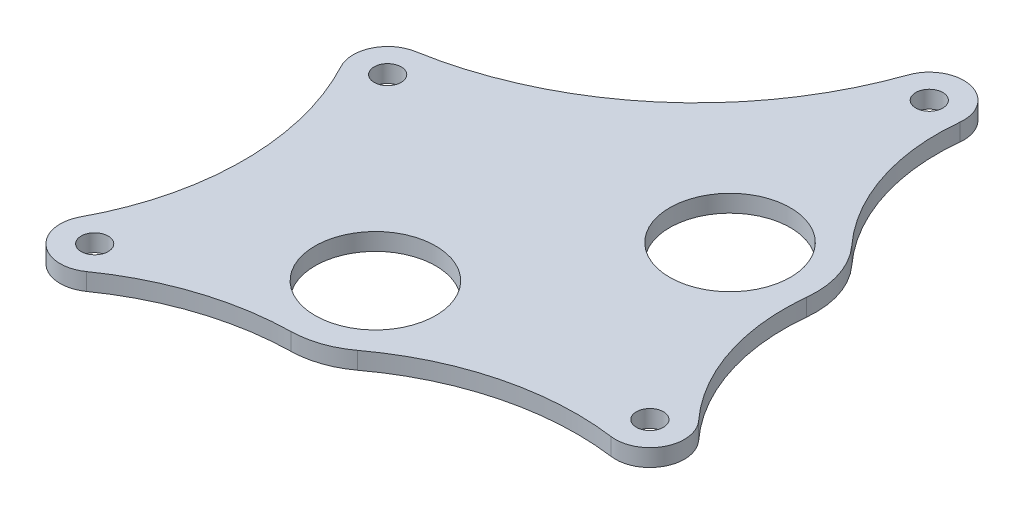
ISO-10303-21;
HEADER;
FILE_DESCRIPTION(('STEP AP214'),'2;1');
FILE_NAME('part.step','',(''),(''),'','','');
FILE_SCHEMA(('AUTOMOTIVE_DESIGN { 1 0 10303 214 1 1 1 1 }'));
ENDSEC;
DATA;
#1=APPLICATION_CONTEXT('core data for automotive mechanical design processes');
#2=APPLICATION_PROTOCOL_DEFINITION('international standard','automotive_design',2000,#1);
#3=PRODUCT_CONTEXT('',#1,'mechanical');
#4=PRODUCT('Part','Part','',(#3));
#5=PRODUCT_RELATED_PRODUCT_CATEGORY('part','',(#4));
#6=PRODUCT_DEFINITION_FORMATION('','',#4);
#7=PRODUCT_DEFINITION_CONTEXT('part definition',#1,'design');
#8=PRODUCT_DEFINITION('design','',#6,#7);
#9=PRODUCT_DEFINITION_SHAPE('','',#8);
#10=(LENGTH_UNIT() NAMED_UNIT(*) SI_UNIT(.MILLI.,.METRE.));
#11=(NAMED_UNIT(*) PLANE_ANGLE_UNIT() SI_UNIT($,.RADIAN.));
#12=(NAMED_UNIT(*) SI_UNIT($,.STERADIAN.) SOLID_ANGLE_UNIT());
#13=UNCERTAINTY_MEASURE_WITH_UNIT(LENGTH_MEASURE(1.E-05),#10,'distance_accuracy_value','');
#14=(GEOMETRIC_REPRESENTATION_CONTEXT(3) GLOBAL_UNCERTAINTY_ASSIGNED_CONTEXT((#13)) GLOBAL_UNIT_ASSIGNED_CONTEXT((#10,
#11,#12)) REPRESENTATION_CONTEXT('',''));
#15=CARTESIAN_POINT('',(0.,0.,0.));
#16=DIRECTION('',(0.,0.,1.));
#17=DIRECTION('',(1.,0.,0.));
#18=AXIS2_PLACEMENT_3D('',#15,#16,#17);
#19=CARTESIAN_POINT('',(40.1473132785361,14.6049999999996,-115.016732099235));
#20=DIRECTION('',(0.,1.,0.));
#21=DIRECTION('',(0.,0.,1.));
#22=AXIS2_PLACEMENT_3D('',#19,#20,#21);
#23=PLANE('',#22);
#24=CARTESIAN_POINT('',(20.2144717895034,14.6049999999997,-96.823134697316));
#25=DIRECTION('',(0.,1.,0.));
#26=DIRECTION('',(0.,0.,1.));
#27=AXIS2_PLACEMENT_3D('',#24,#25,#26);
#28=CIRCLE('',#27,11.1125);
#29=CARTESIAN_POINT('',(20.2144717895034,14.6049999999997,-85.710634697316));
#30=VERTEX_POINT('',#29);
#31=EDGE_CURVE('E299',#30,#30,#28,.T.);
#32=ORIENTED_EDGE('',*,*,#31,.F.);
#33=EDGE_LOOP('',(#32));
#34=FACE_BOUND('',#33,.T.);
#35=CARTESIAN_POINT('',(15.8750000000005,14.6049999999995,-137.869384338277));
#36=DIRECTION('',(0.,1.,0.));
#37=DIRECTION('',(0.,0.,1.));
#38=AXIS2_PLACEMENT_3D('',#35,#36,#37);
#39=CIRCLE('',#38,2.4892);
#40=CARTESIAN_POINT('',(15.8750000000005,14.6049999999995,-135.380184338277));
#41=VERTEX_POINT('',#40);
#42=EDGE_CURVE('E311',#41,#41,#39,.T.);
#43=ORIENTED_EDGE('',*,*,#42,.F.);
#44=EDGE_LOOP('',(#43));
#45=FACE_BOUND('',#44,.T.);
#46=CARTESIAN_POINT('',(-38.0999999999997,14.6049999999997,-92.0750000000001));
#47=DIRECTION('',(0.,1.,0.));
#48=DIRECTION('',(0.,0.,1.));
#49=AXIS2_PLACEMENT_3D('',#46,#47,#48);
#50=CIRCLE('',#49,2.4892);
#51=CARTESIAN_POINT('',(-38.0999999999997,14.6049999999997,-89.5858000000001));
#52=VERTEX_POINT('',#51);
#53=EDGE_CURVE('E158',#52,#52,#50,.T.);
#54=ORIENTED_EDGE('',*,*,#53,.F.);
#55=EDGE_LOOP('',(#54));
#56=FACE_BOUND('',#55,.T.);
#57=CARTESIAN_POINT('',(60.0801547675688,14.6049999999995,-133.210329501153));
#58=DIRECTION('',(0.,-1.,0.));
#59=DIRECTION('',(0.,0.,1.));
#60=AXIS2_PLACEMENT_3D('',#57,#58,#59);
#61=CIRCLE('',#60,38.1);
#62=CARTESIAN_POINT('',(31.939672665405,14.6049999999996,-107.525250816092));
#63=VERTEX_POINT('',#62);
#64=CARTESIAN_POINT('',(22.1900221096531,14.6049999999995,-137.203805075831));
#65=VERTEX_POINT('',#64);
#66=EDGE_CURVE('E177',#63,#65,#61,.T.);
#67=ORIENTED_EDGE('',*,*,#66,.T.);
#68=CARTESIAN_POINT('',(15.8750000000005,14.6049999999995,-137.869384338277));
#69=DIRECTION('',(0.,1.,0.));
#70=DIRECTION('',(0.,0.,1.));
#71=AXIS2_PLACEMENT_3D('',#68,#69,#70);
#72=CIRCLE('',#71,6.34999999999999);
#73=CARTESIAN_POINT('',(9.8798155737633,14.6049999999995,-139.962292290244));
#74=VERTEX_POINT('',#73);
#75=EDGE_CURVE('E105',#65,#74,#72,.T.);
#76=ORIENTED_EDGE('',*,*,#75,.T.);
#77=CARTESIAN_POINT('',(-50.0720286886084,14.6049999999994,-160.891371809905));
#78=DIRECTION('',(0.,-1.,0.));
#79=DIRECTION('',(0.,0.,1.));
#80=AXIS2_PLACEMENT_3D('',#77,#78,#79);
#81=CIRCLE('',#80,63.5);
#82=CARTESIAN_POINT('',(-39.1883662444187,14.6049999999997,-98.3310338009006));
#83=VERTEX_POINT('',#82);
#84=EDGE_CURVE('E204',#74,#83,#81,.T.);
#85=ORIENTED_EDGE('',*,*,#84,.T.);
#86=CARTESIAN_POINT('',(-38.0999999999997,14.6049999999997,-92.0750000000001));
#87=DIRECTION('',(0.,1.,0.));
#88=DIRECTION('',(0.,0.,1.));
#89=AXIS2_PLACEMENT_3D('',#86,#87,#88);
#90=CIRCLE('',#89,6.35000000000001);
#91=CARTESIAN_POINT('',(-43.6973950552304,14.6049999999997,-89.076388888889));
#92=VERTEX_POINT('',#91);
#93=EDGE_CURVE('E223',#83,#92,#90,.T.);
#94=ORIENTED_EDGE('',*,*,#93,.T.);
#95=CARTESIAN_POINT('',(-88.476555497076,14.6049999999998,-65.0875000000003));
#96=DIRECTION('',(0.,-1.,0.));
#97=DIRECTION('',(0.,0.,-1.));
#98=AXIS2_PLACEMENT_3D('',#95,#96,#97);
#99=CIRCLE('',#98,50.8);
#100=CARTESIAN_POINT('',(-43.6973950552306,14.6049999999999,-41.0986111111113));
#101=VERTEX_POINT('',#100);
#102=EDGE_CURVE('E220',#92,#101,#99,.T.);
#103=ORIENTED_EDGE('',*,*,#102,.T.);
#104=CARTESIAN_POINT('',(-38.0999999999999,14.6049999999999,-38.1000000000001));
#105=DIRECTION('',(0.,1.,0.));
#106=DIRECTION('',(0.,0.,1.));
#107=AXIS2_PLACEMENT_3D('',#104,#105,#106);
#108=CIRCLE('',#107,6.35000000000001);
#109=CARTESIAN_POINT('',(-34.4399813892511,14.6049999999999,-32.9108995221742));
#110=VERTEX_POINT('',#109);
#111=EDGE_CURVE('E222',#101,#110,#108,.T.);
#112=ORIENTED_EDGE('',*,*,#111,.T.);
#113=CARTESIAN_POINT('',(-5.15983250326102,14.605,8.60190430043274));
#114=DIRECTION('',(0.,-1.,0.));
#115=DIRECTION('',(0.,0.,-1.));
#116=AXIS2_PLACEMENT_3D('',#113,#114,#115);
#117=CIRCLE('',#116,50.8);
#118=CARTESIAN_POINT('',(-6.0666267864905,14.6049999999999,-42.1900017883124));
#119=VERTEX_POINT('',#118);
#120=EDGE_CURVE('E225',#110,#119,#117,.T.);
#121=ORIENTED_EDGE('',*,*,#120,.T.);
#122=CARTESIAN_POINT('',(-6.34999999999968,14.6049999999998,-58.0624724410452));
#123=DIRECTION('',(0.,1.,0.));
#124=DIRECTION('',(0.,0.,1.));
#125=AXIS2_PLACEMENT_3D('',#122,#123,#124);
#126=CIRCLE('',#125,15.875);
#127=CARTESIAN_POINT('',(3.12599915289644,14.6049999999998,-45.3258690848002));
#128=VERTEX_POINT('',#127);
#129=EDGE_CURVE('E231',#119,#128,#126,.T.);
#130=ORIENTED_EDGE('',*,*,#129,.T.);
#131=CARTESIAN_POINT('',(33.449196442164,14.605,-4.56873834481612));
#132=DIRECTION('',(0.,-1.,0.));
#133=DIRECTION('',(0.,0.,1.));
#134=AXIS2_PLACEMENT_3D('',#131,#132,#133);
#135=CIRCLE('',#134,50.8);
#136=CARTESIAN_POINT('',(40.2277459517591,14.6049999999998,-54.9144558046554));
#137=VERTEX_POINT('',#136);
#138=EDGE_CURVE('E136',#128,#137,#135,.T.);
#139=ORIENTED_EDGE('',*,*,#138,.T.);
#140=CARTESIAN_POINT('',(41.0750646404585,14.6049999999998,-61.2076704871353));
#141=DIRECTION('',(0.,1.,0.));
#142=DIRECTION('',(0.,0.,1.));
#143=AXIS2_PLACEMENT_3D('',#140,#141,#142);
#144=CIRCLE('',#143,6.35000000000001);
#145=CARTESIAN_POINT('',(45.7635261068066,14.6049999999998,-65.4902899050347));
#146=VERTEX_POINT('',#145);
#147=EDGE_CURVE('E130',#137,#146,#144,.T.);
#148=ORIENTED_EDGE('',*,*,#147,.T.);
#149=CARTESIAN_POINT('',(73.8942949048952,14.6049999999997,-91.1860064124312));
#150=DIRECTION('',(0.,-1.,0.));
#151=DIRECTION('',(0.,0.,1.));
#152=AXIS2_PLACEMENT_3D('',#149,#150,#151);
#153=CIRCLE('',#152,38.1);
#154=CARTESIAN_POINT('',(36.0026550587363,14.6049999999997,-95.1651557899969));
#155=VERTEX_POINT('',#154);
#156=EDGE_CURVE('E134',#146,#155,#153,.T.);
#157=ORIENTED_EDGE('',*,*,#156,.T.);
#158=CARTESIAN_POINT('',(20.2144717895034,14.6049999999997,-96.823134697316));
#159=DIRECTION('',(0.,1.,0.));
#160=DIRECTION('',(0.,0.,1.));
#161=AXIS2_PLACEMENT_3D('',#158,#159,#160);
#162=CIRCLE('',#161,15.875);
#163=EDGE_CURVE('E50',#155,#63,#162,.T.);
#164=ORIENTED_EDGE('',*,*,#163,.T.);
#165=EDGE_LOOP('',(#67,#76,#85,#94,#103,#112,#121,#130,#139,#148,#157,#164));
#166=FACE_BOUND('',#165,.T.);
#167=CARTESIAN_POINT('',(-38.0999999999999,14.6049999999999,-38.1000000000001));
#168=DIRECTION('',(0.,1.,0.));
#169=DIRECTION('',(0.,0.,1.));
#170=AXIS2_PLACEMENT_3D('',#167,#168,#169);
#171=CIRCLE('',#170,2.4892);
#172=CARTESIAN_POINT('',(-38.0999999999999,14.6049999999999,-35.6108000000001));
#173=VERTEX_POINT('',#172);
#174=EDGE_CURVE('E317',#173,#173,#171,.T.);
#175=ORIENTED_EDGE('',*,*,#174,.F.);
#176=EDGE_LOOP('',(#175));
#177=FACE_BOUND('',#176,.T.);
#178=CARTESIAN_POINT('',(41.0750646404585,14.6049999999998,-61.2076704871353));
#179=DIRECTION('',(0.,1.,0.));
#180=DIRECTION('',(0.,0.,1.));
#181=AXIS2_PLACEMENT_3D('',#178,#179,#180);
#182=CIRCLE('',#181,2.4892);
#183=CARTESIAN_POINT('',(41.0750646404585,14.6049999999998,-58.7184704871353));
#184=VERTEX_POINT('',#183);
#185=EDGE_CURVE('E305',#184,#184,#182,.T.);
#186=ORIENTED_EDGE('',*,*,#185,.F.);
#187=EDGE_LOOP('',(#186));
#188=FACE_BOUND('',#187,.T.);
#189=CARTESIAN_POINT('',(-6.34999999999968,14.6049999999998,-58.0624724410452));
#190=DIRECTION('',(0.,1.,0.));
#191=DIRECTION('',(0.,0.,1.));
#192=AXIS2_PLACEMENT_3D('',#189,#190,#191);
#193=CIRCLE('',#192,11.1125);
#194=CARTESIAN_POINT('',(-6.34999999999968,14.6049999999998,-46.9499724410452));
#195=VERTEX_POINT('',#194);
#196=EDGE_CURVE('E290',#195,#195,#193,.T.);
#197=ORIENTED_EDGE('',*,*,#196,.F.);
#198=EDGE_LOOP('',(#197));
#199=FACE_BOUND('',#198,.T.);
#200=ADVANCED_FACE('F33',(#34,#45,#56,#166,#177,#188,#199),#23,.T.);
#201=CARTESIAN_POINT('',(40.1473132785361,11.4299999999996,-115.016732099234));
#202=DIRECTION('',(0.,1.,0.));
#203=DIRECTION('',(0.,0.,1.));
#204=AXIS2_PLACEMENT_3D('',#201,#202,#203);
#205=PLANE('',#204);
#206=CARTESIAN_POINT('',(60.0801547675688,11.4299999999995,-133.210329501153));
#207=DIRECTION('',(0.,-1.,0.));
#208=DIRECTION('',(0.,0.,1.));
#209=AXIS2_PLACEMENT_3D('',#206,#207,#208);
#210=CIRCLE('',#209,38.1);
#211=CARTESIAN_POINT('',(31.939672665405,11.4299999999996,-107.525250816092));
#212=VERTEX_POINT('',#211);
#213=CARTESIAN_POINT('',(22.1900221096531,11.4299999999995,-137.203805075831));
#214=VERTEX_POINT('',#213);
#215=EDGE_CURVE('E154',#212,#214,#210,.T.);
#216=ORIENTED_EDGE('',*,*,#215,.F.);
#217=CARTESIAN_POINT('',(20.2144717895034,11.4299999999997,-96.823134697316));
#218=DIRECTION('',(0.,1.,0.));
#219=DIRECTION('',(0.,0.,1.));
#220=AXIS2_PLACEMENT_3D('',#217,#218,#219);
#221=CIRCLE('',#220,15.875);
#222=CARTESIAN_POINT('',(36.0026550587363,11.4299999999997,-95.1651557899969));
#223=VERTEX_POINT('',#222);
#224=EDGE_CURVE('E97',#223,#212,#221,.T.);
#225=ORIENTED_EDGE('',*,*,#224,.F.);
#226=CARTESIAN_POINT('',(73.8942949048952,11.4299999999997,-91.1860064124311));
#227=DIRECTION('',(0.,-1.,0.));
#228=DIRECTION('',(0.,0.,1.));
#229=AXIS2_PLACEMENT_3D('',#226,#227,#228);
#230=CIRCLE('',#229,38.1);
#231=CARTESIAN_POINT('',(45.7635261068066,11.4299999999998,-65.4902899050347));
#232=VERTEX_POINT('',#231);
#233=EDGE_CURVE('E91',#232,#223,#230,.T.);
#234=ORIENTED_EDGE('',*,*,#233,.F.);
#235=CARTESIAN_POINT('',(41.0750646404585,11.4299999999998,-61.2076704871353));
#236=DIRECTION('',(0.,1.,0.));
#237=DIRECTION('',(0.,0.,1.));
#238=AXIS2_PLACEMENT_3D('',#235,#236,#237);
#239=CIRCLE('',#238,6.35000000000001);
#240=CARTESIAN_POINT('',(40.2277459517591,11.4299999999998,-54.9144558046554));
#241=VERTEX_POINT('',#240);
#242=EDGE_CURVE('E144',#241,#232,#239,.T.);
#243=ORIENTED_EDGE('',*,*,#242,.F.);
#244=CARTESIAN_POINT('',(33.449196442164,11.43,-4.56873834481611));
#245=DIRECTION('',(0.,-1.,0.));
#246=DIRECTION('',(0.,0.,1.));
#247=AXIS2_PLACEMENT_3D('',#244,#245,#246);
#248=CIRCLE('',#247,50.8);
#249=CARTESIAN_POINT('',(3.12599915289644,11.4299999999998,-45.3258690848002));
#250=VERTEX_POINT('',#249);
#251=EDGE_CURVE('E172',#250,#241,#248,.T.);
#252=ORIENTED_EDGE('',*,*,#251,.F.);
#253=CARTESIAN_POINT('',(-6.34999999999968,11.4299999999998,-58.0624724410452));
#254=DIRECTION('',(0.,1.,0.));
#255=DIRECTION('',(0.,0.,1.));
#256=AXIS2_PLACEMENT_3D('',#253,#254,#255);
#257=CIRCLE('',#256,15.875);
#258=CARTESIAN_POINT('',(-6.0666267864905,11.4299999999999,-42.1900017883124));
#259=VERTEX_POINT('',#258);
#260=EDGE_CURVE('E170',#259,#250,#257,.T.);
#261=ORIENTED_EDGE('',*,*,#260,.F.);
#262=CARTESIAN_POINT('',(-5.15983250326102,11.43,8.60190430043275));
#263=DIRECTION('',(0.,-1.,0.));
#264=DIRECTION('',(0.,0.,-1.));
#265=AXIS2_PLACEMENT_3D('',#262,#263,#264);
#266=CIRCLE('',#265,50.8);
#267=CARTESIAN_POINT('',(-34.4399813892511,11.4299999999999,-32.9108995221742));
#268=VERTEX_POINT('',#267);
#269=EDGE_CURVE('E168',#268,#259,#266,.T.);
#270=ORIENTED_EDGE('',*,*,#269,.F.);
#271=CARTESIAN_POINT('',(-38.0999999999999,11.4299999999999,-38.1000000000001));
#272=DIRECTION('',(0.,1.,0.));
#273=DIRECTION('',(0.,0.,1.));
#274=AXIS2_PLACEMENT_3D('',#271,#272,#273);
#275=CIRCLE('',#274,6.35000000000001);
#276=CARTESIAN_POINT('',(-43.6973950552306,11.4299999999999,-41.0986111111112));
#277=VERTEX_POINT('',#276);
#278=EDGE_CURVE('E166',#277,#268,#275,.T.);
#279=ORIENTED_EDGE('',*,*,#278,.F.);
#280=CARTESIAN_POINT('',(-88.476555497076,11.4299999999998,-65.0875000000003));
#281=DIRECTION('',(0.,-1.,0.));
#282=DIRECTION('',(0.,0.,-1.));
#283=AXIS2_PLACEMENT_3D('',#280,#281,#282);
#284=CIRCLE('',#283,50.8);
#285=CARTESIAN_POINT('',(-43.6973950552304,11.4299999999997,-89.076388888889));
#286=VERTEX_POINT('',#285);
#287=EDGE_CURVE('E164',#286,#277,#284,.T.);
#288=ORIENTED_EDGE('',*,*,#287,.F.);
#289=CARTESIAN_POINT('',(-38.0999999999997,11.4299999999997,-92.0750000000001));
#290=DIRECTION('',(0.,1.,0.));
#291=DIRECTION('',(0.,0.,1.));
#292=AXIS2_PLACEMENT_3D('',#289,#290,#291);
#293=CIRCLE('',#292,6.35000000000001);
#294=CARTESIAN_POINT('',(-39.1883662444187,11.4299999999997,-98.3310338009006));
#295=VERTEX_POINT('',#294);
#296=EDGE_CURVE('E162',#295,#286,#293,.T.);
#297=ORIENTED_EDGE('',*,*,#296,.F.);
#298=CARTESIAN_POINT('',(-50.0720286886084,11.4299999999994,-160.891371809905));
#299=DIRECTION('',(0.,-1.,0.));
#300=DIRECTION('',(0.,0.,1.));
#301=AXIS2_PLACEMENT_3D('',#298,#299,#300);
#302=CIRCLE('',#301,63.5);
#303=CARTESIAN_POINT('',(9.8798155737633,11.4299999999995,-139.962292290244));
#304=VERTEX_POINT('',#303);
#305=EDGE_CURVE('E160',#304,#295,#302,.T.);
#306=ORIENTED_EDGE('',*,*,#305,.F.);
#307=CARTESIAN_POINT('',(15.8750000000005,11.4299999999995,-137.869384338277));
#308=DIRECTION('',(0.,1.,0.));
#309=DIRECTION('',(0.,0.,1.));
#310=AXIS2_PLACEMENT_3D('',#307,#308,#309);
#311=CIRCLE('',#310,6.34999999999999);
#312=EDGE_CURVE('E157',#214,#304,#311,.T.);
#313=ORIENTED_EDGE('',*,*,#312,.F.);
#314=EDGE_LOOP('',(#216,#225,#234,#243,#252,#261,#270,#279,#288,#297,#306,#313));
#315=FACE_BOUND('',#314,.T.);
#316=CARTESIAN_POINT('',(-38.0999999999997,11.4299999999997,-92.0750000000001));
#317=DIRECTION('',(0.,1.,0.));
#318=DIRECTION('',(0.,0.,1.));
#319=AXIS2_PLACEMENT_3D('',#316,#317,#318);
#320=CIRCLE('',#319,2.4892);
#321=CARTESIAN_POINT('',(-38.0999999999997,11.4299999999997,-89.5858000000001));
#322=VERTEX_POINT('',#321);
#323=EDGE_CURVE('E320',#322,#322,#320,.T.);
#324=ORIENTED_EDGE('',*,*,#323,.T.);
#325=EDGE_LOOP('',(#324));
#326=FACE_BOUND('',#325,.T.);
#327=CARTESIAN_POINT('',(-38.0999999999999,11.4299999999999,-38.1000000000001));
#328=DIRECTION('',(0.,1.,0.));
#329=DIRECTION('',(0.,0.,1.));
#330=AXIS2_PLACEMENT_3D('',#327,#328,#329);
#331=CIRCLE('',#330,2.4892);
#332=CARTESIAN_POINT('',(-38.0999999999999,11.4299999999999,-35.6108000000001));
#333=VERTEX_POINT('',#332);
#334=EDGE_CURVE('E314',#333,#333,#331,.T.);
#335=ORIENTED_EDGE('',*,*,#334,.T.);
#336=EDGE_LOOP('',(#335));
#337=FACE_BOUND('',#336,.T.);
#338=CARTESIAN_POINT('',(15.8750000000005,11.4299999999995,-137.869384338277));
#339=DIRECTION('',(0.,1.,0.));
#340=DIRECTION('',(0.,0.,1.));
#341=AXIS2_PLACEMENT_3D('',#338,#339,#340);
#342=CIRCLE('',#341,2.4892);
#343=CARTESIAN_POINT('',(15.8750000000005,11.4299999999995,-135.380184338277));
#344=VERTEX_POINT('',#343);
#345=EDGE_CURVE('E308',#344,#344,#342,.T.);
#346=ORIENTED_EDGE('',*,*,#345,.T.);
#347=EDGE_LOOP('',(#346));
#348=FACE_BOUND('',#347,.T.);
#349=CARTESIAN_POINT('',(41.0750646404585,11.4299999999998,-61.2076704871353));
#350=DIRECTION('',(0.,1.,0.));
#351=DIRECTION('',(0.,0.,1.));
#352=AXIS2_PLACEMENT_3D('',#349,#350,#351);
#353=CIRCLE('',#352,2.4892);
#354=CARTESIAN_POINT('',(41.0750646404585,11.4299999999998,-58.7184704871353));
#355=VERTEX_POINT('',#354);
#356=EDGE_CURVE('E302',#355,#355,#353,.T.);
#357=ORIENTED_EDGE('',*,*,#356,.T.);
#358=EDGE_LOOP('',(#357));
#359=FACE_BOUND('',#358,.T.);
#360=CARTESIAN_POINT('',(20.2144717895034,11.4299999999997,-96.823134697316));
#361=DIRECTION('',(0.,1.,0.));
#362=DIRECTION('',(0.,0.,1.));
#363=AXIS2_PLACEMENT_3D('',#360,#361,#362);
#364=CIRCLE('',#363,11.1125);
#365=CARTESIAN_POINT('',(20.2144717895034,11.4299999999997,-85.710634697316));
#366=VERTEX_POINT('',#365);
#367=EDGE_CURVE('E296',#366,#366,#364,.T.);
#368=ORIENTED_EDGE('',*,*,#367,.T.);
#369=EDGE_LOOP('',(#368));
#370=FACE_BOUND('',#369,.T.);
#371=CARTESIAN_POINT('',(-6.34999999999968,11.4299999999998,-58.0624724410452));
#372=DIRECTION('',(0.,1.,0.));
#373=DIRECTION('',(0.,0.,1.));
#374=AXIS2_PLACEMENT_3D('',#371,#372,#373);
#375=CIRCLE('',#374,11.1125);
#376=CARTESIAN_POINT('',(-6.34999999999968,11.4299999999998,-46.9499724410452));
#377=VERTEX_POINT('',#376);
#378=EDGE_CURVE('E293',#377,#377,#375,.T.);
#379=ORIENTED_EDGE('',*,*,#378,.T.);
#380=EDGE_LOOP('',(#379));
#381=FACE_BOUND('',#380,.T.);
#382=ADVANCED_FACE('F208',(#315,#326,#337,#348,#359,#370,#381),#205,.F.);
#383=CARTESIAN_POINT('',(60.0801547675688,14.6049999999995,-133.210329501153));
#384=DIRECTION('',(0.,-1.,0.));
#385=DIRECTION('',(0.,0.,-1.));
#386=AXIS2_PLACEMENT_3D('',#383,#384,#385);
#387=CYLINDRICAL_SURFACE('',#386,38.1);
#388=ORIENTED_EDGE('',*,*,#215,.T.);
#389=DIRECTION('',(0.,-1.,0.));
#390=VECTOR('',#389,1.);
#391=CARTESIAN_POINT('',(22.1900221096531,14.6049999999995,-137.203805075831));
#392=LINE('',#391,#390);
#393=EDGE_CURVE('E11',#65,#214,#392,.T.);
#394=ORIENTED_EDGE('',*,*,#393,.F.);
#395=ORIENTED_EDGE('',*,*,#66,.F.);
#396=DIRECTION('',(0.,-1.,0.));
#397=VECTOR('',#396,1.);
#398=CARTESIAN_POINT('',(31.939672665405,14.6049999999996,-107.525250816092));
#399=LINE('',#398,#397);
#400=EDGE_CURVE('E150',#63,#212,#399,.T.);
#401=ORIENTED_EDGE('',*,*,#400,.T.);
#402=EDGE_LOOP('',(#388,#394,#395,#401));
#403=FACE_BOUND('',#402,.T.);
#404=ADVANCED_FACE('F35',(#403),#387,.F.);
#405=CARTESIAN_POINT('',(15.8750000000005,14.6049999999995,-137.869384338277));
#406=DIRECTION('',(0.,-1.,0.));
#407=DIRECTION('',(0.,0.,-1.));
#408=AXIS2_PLACEMENT_3D('',#405,#406,#407);
#409=CYLINDRICAL_SURFACE('',#408,6.34999999999999);
#410=ORIENTED_EDGE('',*,*,#312,.T.);
#411=DIRECTION('',(0.,-1.,0.));
#412=VECTOR('',#411,1.);
#413=CARTESIAN_POINT('',(9.8798155737633,14.6049999999995,-139.962292290244));
#414=LINE('',#413,#412);
#415=EDGE_CURVE('E42',#74,#304,#414,.T.);
#416=ORIENTED_EDGE('',*,*,#415,.F.);
#417=ORIENTED_EDGE('',*,*,#75,.F.);
#418=ORIENTED_EDGE('',*,*,#393,.T.);
#419=EDGE_LOOP('',(#410,#416,#417,#418));
#420=FACE_BOUND('',#419,.T.);
#421=ADVANCED_FACE('F448',(#420),#409,.T.);
#422=CARTESIAN_POINT('',(-50.0720286886084,14.6049999999994,-160.891371809905));
#423=DIRECTION('',(0.,-1.,0.));
#424=DIRECTION('',(0.,0.,-1.));
#425=AXIS2_PLACEMENT_3D('',#422,#423,#424);
#426=CYLINDRICAL_SURFACE('',#425,63.5);
#427=ORIENTED_EDGE('',*,*,#305,.T.);
#428=DIRECTION('',(0.,-1.,0.));
#429=VECTOR('',#428,1.);
#430=CARTESIAN_POINT('',(-39.1883662444187,14.6049999999997,-98.3310338009006));
#431=LINE('',#430,#429);
#432=EDGE_CURVE('E196',#83,#295,#431,.T.);
#433=ORIENTED_EDGE('',*,*,#432,.F.);
#434=ORIENTED_EDGE('',*,*,#84,.F.);
#435=ORIENTED_EDGE('',*,*,#415,.T.);
#436=EDGE_LOOP('',(#427,#433,#434,#435));
#437=FACE_BOUND('',#436,.T.);
#438=ADVANCED_FACE('F202',(#437),#426,.F.);
#439=CARTESIAN_POINT('',(-38.0999999999997,14.6049999999997,-92.0750000000001));
#440=DIRECTION('',(0.,-1.,0.));
#441=DIRECTION('',(0.,0.,-1.));
#442=AXIS2_PLACEMENT_3D('',#439,#440,#441);
#443=CYLINDRICAL_SURFACE('',#442,6.35000000000001);
#444=ORIENTED_EDGE('',*,*,#296,.T.);
#445=DIRECTION('',(0.,-1.,0.));
#446=VECTOR('',#445,1.);
#447=CARTESIAN_POINT('',(-43.6973950552304,14.6049999999997,-89.076388888889));
#448=LINE('',#447,#446);
#449=EDGE_CURVE('E193',#92,#286,#448,.T.);
#450=ORIENTED_EDGE('',*,*,#449,.F.);
#451=ORIENTED_EDGE('',*,*,#93,.F.);
#452=ORIENTED_EDGE('',*,*,#432,.T.);
#453=EDGE_LOOP('',(#444,#450,#451,#452));
#454=FACE_BOUND('',#453,.T.);
#455=ADVANCED_FACE('F214',(#454),#443,.T.);
#456=CARTESIAN_POINT('',(-88.476555497076,14.6049999999998,-65.0875000000003));
#457=DIRECTION('',(0.,-1.,0.));
#458=DIRECTION('',(0.,0.,-1.));
#459=AXIS2_PLACEMENT_3D('',#456,#457,#458);
#460=CYLINDRICAL_SURFACE('',#459,50.8);
#461=ORIENTED_EDGE('',*,*,#287,.T.);
#462=DIRECTION('',(0.,-1.,0.));
#463=VECTOR('',#462,1.);
#464=CARTESIAN_POINT('',(-43.6973950552306,14.6049999999999,-41.0986111111113));
#465=LINE('',#464,#463);
#466=EDGE_CURVE('E190',#101,#277,#465,.T.);
#467=ORIENTED_EDGE('',*,*,#466,.F.);
#468=ORIENTED_EDGE('',*,*,#102,.F.);
#469=ORIENTED_EDGE('',*,*,#449,.T.);
#470=EDGE_LOOP('',(#461,#467,#468,#469));
#471=FACE_BOUND('',#470,.T.);
#472=ADVANCED_FACE('F218',(#471),#460,.F.);
#473=CARTESIAN_POINT('',(-38.0999999999999,14.6049999999999,-38.1000000000001));
#474=DIRECTION('',(0.,-1.,0.));
#475=DIRECTION('',(0.,0.,-1.));
#476=AXIS2_PLACEMENT_3D('',#473,#474,#475);
#477=CYLINDRICAL_SURFACE('',#476,6.35000000000001);
#478=ORIENTED_EDGE('',*,*,#278,.T.);
#479=DIRECTION('',(0.,-1.,0.));
#480=VECTOR('',#479,1.);
#481=CARTESIAN_POINT('',(-34.4399813892511,14.6049999999999,-32.9108995221742));
#482=LINE('',#481,#480);
#483=EDGE_CURVE('E187',#110,#268,#482,.T.);
#484=ORIENTED_EDGE('',*,*,#483,.F.);
#485=ORIENTED_EDGE('',*,*,#111,.F.);
#486=ORIENTED_EDGE('',*,*,#466,.T.);
#487=EDGE_LOOP('',(#478,#484,#485,#486));
#488=FACE_BOUND('',#487,.T.);
#489=ADVANCED_FACE('F413',(#488),#477,.T.);
#490=CARTESIAN_POINT('',(-5.15983250326102,14.605,8.60190430043274));
#491=DIRECTION('',(0.,-1.,0.));
#492=DIRECTION('',(0.,0.,-1.));
#493=AXIS2_PLACEMENT_3D('',#490,#491,#492);
#494=CYLINDRICAL_SURFACE('',#493,50.8);
#495=ORIENTED_EDGE('',*,*,#269,.T.);
#496=DIRECTION('',(0.,-1.,0.));
#497=VECTOR('',#496,1.);
#498=CARTESIAN_POINT('',(-6.0666267864905,14.6049999999999,-42.1900017883124));
#499=LINE('',#498,#497);
#500=EDGE_CURVE('E184',#119,#259,#499,.T.);
#501=ORIENTED_EDGE('',*,*,#500,.F.);
#502=ORIENTED_EDGE('',*,*,#120,.F.);
#503=ORIENTED_EDGE('',*,*,#483,.T.);
#504=EDGE_LOOP('',(#495,#501,#502,#503));
#505=FACE_BOUND('',#504,.T.);
#506=ADVANCED_FACE('F404',(#505),#494,.F.);
#507=CARTESIAN_POINT('',(-6.34999999999968,14.6049999999998,-58.0624724410452));
#508=DIRECTION('',(0.,-1.,0.));
#509=DIRECTION('',(0.,0.,-1.));
#510=AXIS2_PLACEMENT_3D('',#507,#508,#509);
#511=CYLINDRICAL_SURFACE('',#510,15.875);
#512=ORIENTED_EDGE('',*,*,#260,.T.);
#513=DIRECTION('',(0.,-1.,0.));
#514=VECTOR('',#513,1.);
#515=CARTESIAN_POINT('',(3.12599915289644,14.6049999999998,-45.3258690848002));
#516=LINE('',#515,#514);
#517=EDGE_CURVE('E181',#128,#250,#516,.T.);
#518=ORIENTED_EDGE('',*,*,#517,.F.);
#519=ORIENTED_EDGE('',*,*,#129,.F.);
#520=ORIENTED_EDGE('',*,*,#500,.T.);
#521=EDGE_LOOP('',(#512,#518,#519,#520));
#522=FACE_BOUND('',#521,.T.);
#523=ADVANCED_FACE('F237',(#522),#511,.T.);
#524=CARTESIAN_POINT('',(33.449196442164,14.605,-4.56873834481612));
#525=DIRECTION('',(0.,-1.,0.));
#526=DIRECTION('',(0.,0.,-1.));
#527=AXIS2_PLACEMENT_3D('',#524,#525,#526);
#528=CYLINDRICAL_SURFACE('',#527,50.8);
#529=ORIENTED_EDGE('',*,*,#251,.T.);
#530=DIRECTION('',(0.,-1.,0.));
#531=VECTOR('',#530,1.);
#532=CARTESIAN_POINT('',(40.2277459517591,14.6049999999998,-54.9144558046554));
#533=LINE('',#532,#531);
#534=EDGE_CURVE('E145',#137,#241,#533,.T.);
#535=ORIENTED_EDGE('',*,*,#534,.F.);
#536=ORIENTED_EDGE('',*,*,#138,.F.);
#537=ORIENTED_EDGE('',*,*,#517,.T.);
#538=EDGE_LOOP('',(#529,#535,#536,#537));
#539=FACE_BOUND('',#538,.T.);
#540=ADVANCED_FACE('F241',(#539),#528,.F.);
#541=CARTESIAN_POINT('',(41.0750646404585,14.6049999999998,-61.2076704871353));
#542=DIRECTION('',(0.,-1.,0.));
#543=DIRECTION('',(0.,0.,-1.));
#544=AXIS2_PLACEMENT_3D('',#541,#542,#543);
#545=CYLINDRICAL_SURFACE('',#544,6.35000000000001);
#546=ORIENTED_EDGE('',*,*,#242,.T.);
#547=DIRECTION('',(0.,-1.,0.));
#548=VECTOR('',#547,1.);
#549=CARTESIAN_POINT('',(45.7635261068066,14.6049999999998,-65.4902899050347));
#550=LINE('',#549,#548);
#551=EDGE_CURVE('E141',#146,#232,#550,.T.);
#552=ORIENTED_EDGE('',*,*,#551,.F.);
#553=ORIENTED_EDGE('',*,*,#147,.F.);
#554=ORIENTED_EDGE('',*,*,#534,.T.);
#555=EDGE_LOOP('',(#546,#552,#553,#554));
#556=FACE_BOUND('',#555,.T.);
#557=ADVANCED_FACE('F142',(#556),#545,.T.);
#558=CARTESIAN_POINT('',(73.8942949048952,14.6049999999997,-91.1860064124312));
#559=DIRECTION('',(0.,-1.,0.));
#560=DIRECTION('',(0.,0.,-1.));
#561=AXIS2_PLACEMENT_3D('',#558,#559,#560);
#562=CYLINDRICAL_SURFACE('',#561,38.1);
#563=ORIENTED_EDGE('',*,*,#233,.T.);
#564=DIRECTION('',(0.,-1.,0.));
#565=VECTOR('',#564,1.);
#566=CARTESIAN_POINT('',(36.0026550587363,14.6049999999997,-95.1651557899969));
#567=LINE('',#566,#565);
#568=EDGE_CURVE('E146',#155,#223,#567,.T.);
#569=ORIENTED_EDGE('',*,*,#568,.F.);
#570=ORIENTED_EDGE('',*,*,#156,.F.);
#571=ORIENTED_EDGE('',*,*,#551,.T.);
#572=EDGE_LOOP('',(#563,#569,#570,#571));
#573=FACE_BOUND('',#572,.T.);
#574=ADVANCED_FACE('F148',(#573),#562,.F.);
#575=CARTESIAN_POINT('',(20.2144717895034,14.6049999999997,-96.823134697316));
#576=DIRECTION('',(0.,-1.,0.));
#577=DIRECTION('',(0.,0.,-1.));
#578=AXIS2_PLACEMENT_3D('',#575,#576,#577);
#579=CYLINDRICAL_SURFACE('',#578,15.875);
#580=ORIENTED_EDGE('',*,*,#224,.T.);
#581=ORIENTED_EDGE('',*,*,#400,.F.);
#582=ORIENTED_EDGE('',*,*,#163,.F.);
#583=ORIENTED_EDGE('',*,*,#568,.T.);
#584=EDGE_LOOP('',(#580,#581,#582,#583));
#585=FACE_BOUND('',#584,.T.);
#586=ADVANCED_FACE('F245',(#585),#579,.T.);
#587=CARTESIAN_POINT('',(-38.0999999999997,14.6049999999997,-92.0750000000001));
#588=DIRECTION('',(0.,-1.,0.));
#589=DIRECTION('',(0.,0.,-1.));
#590=AXIS2_PLACEMENT_3D('',#587,#588,#589);
#591=CYLINDRICAL_SURFACE('',#590,2.4892);
#592=ORIENTED_EDGE('',*,*,#53,.T.);
#593=EDGE_LOOP('',(#592));
#594=FACE_BOUND('',#593,.T.);
#595=ORIENTED_EDGE('',*,*,#323,.F.);
#596=EDGE_LOOP('',(#595));
#597=FACE_BOUND('',#596,.T.);
#598=ADVANCED_FACE('F247',(#594,#597),#591,.F.);
#599=CARTESIAN_POINT('',(-38.0999999999999,14.6049999999999,-38.1000000000001));
#600=DIRECTION('',(0.,-1.,0.));
#601=DIRECTION('',(0.,0.,-1.));
#602=AXIS2_PLACEMENT_3D('',#599,#600,#601);
#603=CYLINDRICAL_SURFACE('',#602,2.4892);
#604=ORIENTED_EDGE('',*,*,#174,.T.);
#605=EDGE_LOOP('',(#604));
#606=FACE_BOUND('',#605,.T.);
#607=ORIENTED_EDGE('',*,*,#334,.F.);
#608=EDGE_LOOP('',(#607));
#609=FACE_BOUND('',#608,.T.);
#610=ADVANCED_FACE('F253',(#606,#609),#603,.F.);
#611=CARTESIAN_POINT('',(15.8750000000005,14.6049999999995,-137.869384338277));
#612=DIRECTION('',(0.,-1.,0.));
#613=DIRECTION('',(0.,0.,-1.));
#614=AXIS2_PLACEMENT_3D('',#611,#612,#613);
#615=CYLINDRICAL_SURFACE('',#614,2.4892);
#616=ORIENTED_EDGE('',*,*,#42,.T.);
#617=EDGE_LOOP('',(#616));
#618=FACE_BOUND('',#617,.T.);
#619=ORIENTED_EDGE('',*,*,#345,.F.);
#620=EDGE_LOOP('',(#619));
#621=FACE_BOUND('',#620,.T.);
#622=ADVANCED_FACE('F269',(#618,#621),#615,.F.);
#623=CARTESIAN_POINT('',(41.0750646404585,14.6049999999998,-61.2076704871353));
#624=DIRECTION('',(0.,-1.,0.));
#625=DIRECTION('',(0.,0.,-1.));
#626=AXIS2_PLACEMENT_3D('',#623,#624,#625);
#627=CYLINDRICAL_SURFACE('',#626,2.4892);
#628=ORIENTED_EDGE('',*,*,#185,.T.);
#629=EDGE_LOOP('',(#628));
#630=FACE_BOUND('',#629,.T.);
#631=ORIENTED_EDGE('',*,*,#356,.F.);
#632=EDGE_LOOP('',(#631));
#633=FACE_BOUND('',#632,.T.);
#634=ADVANCED_FACE('F273',(#630,#633),#627,.F.);
#635=CARTESIAN_POINT('',(20.2144717895034,14.6049999999997,-96.823134697316));
#636=DIRECTION('',(0.,-1.,0.));
#637=DIRECTION('',(0.,0.,-1.));
#638=AXIS2_PLACEMENT_3D('',#635,#636,#637);
#639=CYLINDRICAL_SURFACE('',#638,11.1125);
#640=ORIENTED_EDGE('',*,*,#31,.T.);
#641=EDGE_LOOP('',(#640));
#642=FACE_BOUND('',#641,.T.);
#643=ORIENTED_EDGE('',*,*,#367,.F.);
#644=EDGE_LOOP('',(#643));
#645=FACE_BOUND('',#644,.T.);
#646=ADVANCED_FACE('F277',(#642,#645),#639,.F.);
#647=CARTESIAN_POINT('',(-6.34999999999968,14.6049999999998,-58.0624724410452));
#648=DIRECTION('',(0.,-1.,0.));
#649=DIRECTION('',(0.,0.,-1.));
#650=AXIS2_PLACEMENT_3D('',#647,#648,#649);
#651=CYLINDRICAL_SURFACE('',#650,11.1125);
#652=ORIENTED_EDGE('',*,*,#196,.T.);
#653=EDGE_LOOP('',(#652));
#654=FACE_BOUND('',#653,.T.);
#655=ORIENTED_EDGE('',*,*,#378,.F.);
#656=EDGE_LOOP('',(#655));
#657=FACE_BOUND('',#656,.T.);
#658=ADVANCED_FACE('F281',(#654,#657),#651,.F.);
#659=CLOSED_SHELL('',(#200,#382,#404,#421,#438,#455,#472,#489,#506,#523,#540,#557,#574,#586,
#598,#610,#622,#634,#646,#658));
#660=MANIFOLD_SOLID_BREP('B2',#659);
#661=ADVANCED_BREP_SHAPE_REPRESENTATION('',(#18,#660),#14);
#662=SHAPE_DEFINITION_REPRESENTATION(#9,#661);
ENDSEC;
END-ISO-10303-21;
